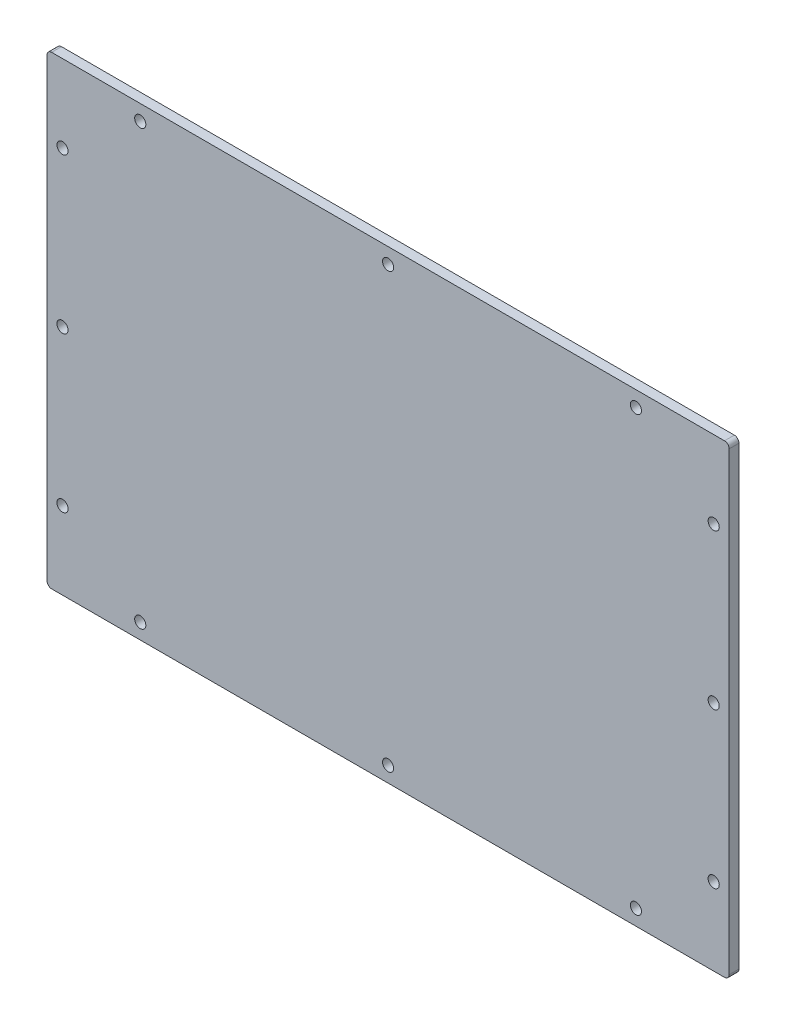
ISO-10303-21;
HEADER;
FILE_DESCRIPTION(('STEP AP214'),'2;1');
FILE_NAME('part.step','',(''),(''),'','','');
FILE_SCHEMA(('AUTOMOTIVE_DESIGN { 1 0 10303 214 1 1 1 1 }'));
ENDSEC;
DATA;
#1=APPLICATION_CONTEXT('core data for automotive mechanical design processes');
#2=APPLICATION_PROTOCOL_DEFINITION('international standard','automotive_design',2000,#1);
#3=PRODUCT_CONTEXT('',#1,'mechanical');
#4=PRODUCT('Part','Part','',(#3));
#5=PRODUCT_RELATED_PRODUCT_CATEGORY('part','',(#4));
#6=PRODUCT_DEFINITION_FORMATION('','',#4);
#7=PRODUCT_DEFINITION_CONTEXT('part definition',#1,'design');
#8=PRODUCT_DEFINITION('design','',#6,#7);
#9=PRODUCT_DEFINITION_SHAPE('','',#8);
#10=(LENGTH_UNIT() NAMED_UNIT(*) SI_UNIT(.MILLI.,.METRE.));
#11=(NAMED_UNIT(*) PLANE_ANGLE_UNIT() SI_UNIT($,.RADIAN.));
#12=(NAMED_UNIT(*) SI_UNIT($,.STERADIAN.) SOLID_ANGLE_UNIT());
#13=UNCERTAINTY_MEASURE_WITH_UNIT(LENGTH_MEASURE(1.E-05),#10,'distance_accuracy_value','');
#14=(GEOMETRIC_REPRESENTATION_CONTEXT(3) GLOBAL_UNCERTAINTY_ASSIGNED_CONTEXT((#13)) GLOBAL_UNIT_ASSIGNED_CONTEXT((#10,
#11,#12)) REPRESENTATION_CONTEXT('',''));
#15=CARTESIAN_POINT('',(0.,0.,0.));
#16=DIRECTION('',(0.,0.,1.));
#17=DIRECTION('',(1.,0.,0.));
#18=AXIS2_PLACEMENT_3D('',#15,#16,#17);
#19=CARTESIAN_POINT('',(0.,-75.,3.175));
#20=DIRECTION('',(0.,1.,0.));
#21=DIRECTION('',(0.,0.,1.));
#22=AXIS2_PLACEMENT_3D('',#19,#20,#21);
#23=PLANE('',#22);
#24=DIRECTION('',(1.,0.,0.));
#25=VECTOR('',#24,1.);
#26=CARTESIAN_POINT('',(0.,-75.,3.175));
#27=LINE('',#26,#25);
#28=CARTESIAN_POINT('',(-108.605,-75.,3.175));
#29=VERTEX_POINT('',#28);
#30=CARTESIAN_POINT('',(108.605,-75.,3.175));
#31=VERTEX_POINT('',#30);
#32=EDGE_CURVE('E126',#29,#31,#27,.T.);
#33=ORIENTED_EDGE('',*,*,#32,.F.);
#34=DIRECTION('',(0.,0.,-1.));
#35=VECTOR('',#34,1.);
#36=CARTESIAN_POINT('',(-108.605,-75.,0.));
#37=LINE('',#36,#35);
#38=CARTESIAN_POINT('',(-108.605,-75.,0.));
#39=VERTEX_POINT('',#38);
#40=EDGE_CURVE('E111',#29,#39,#37,.T.);
#41=ORIENTED_EDGE('',*,*,#40,.T.);
#42=DIRECTION('',(1.,0.,0.));
#43=VECTOR('',#42,1.);
#44=CARTESIAN_POINT('',(0.,-75.,0.));
#45=LINE('',#44,#43);
#46=CARTESIAN_POINT('',(108.605,-75.,0.));
#47=VERTEX_POINT('',#46);
#48=EDGE_CURVE('E123',#39,#47,#45,.T.);
#49=ORIENTED_EDGE('',*,*,#48,.T.);
#50=DIRECTION('',(0.,0.,-1.));
#51=VECTOR('',#50,1.);
#52=CARTESIAN_POINT('',(108.605,-75.,3.175));
#53=LINE('',#52,#51);
#54=EDGE_CURVE('E128',#47,#31,#53,.F.);
#55=ORIENTED_EDGE('',*,*,#54,.T.);
#56=EDGE_LOOP('',(#33,#41,#49,#55));
#57=FACE_BOUND('',#56,.T.);
#58=ADVANCED_FACE('F41',(#57),#23,.F.);
#59=CARTESIAN_POINT('',(110.105,0.,3.175));
#60=DIRECTION('',(-1.,0.,0.));
#61=DIRECTION('',(0.,0.,1.));
#62=AXIS2_PLACEMENT_3D('',#59,#60,#61);
#63=PLANE('',#62);
#64=DIRECTION('',(0.,1.,0.));
#65=VECTOR('',#64,1.);
#66=CARTESIAN_POINT('',(110.105,0.,3.175));
#67=LINE('',#66,#65);
#68=CARTESIAN_POINT('',(110.105,-73.5,3.175));
#69=VERTEX_POINT('',#68);
#70=CARTESIAN_POINT('',(110.105,73.5,3.175));
#71=VERTEX_POINT('',#70);
#72=EDGE_CURVE('E173',#69,#71,#67,.T.);
#73=ORIENTED_EDGE('',*,*,#72,.F.);
#74=DIRECTION('',(0.,0.,-1.));
#75=VECTOR('',#74,1.);
#76=CARTESIAN_POINT('',(110.105,-73.5,3.175));
#77=LINE('',#76,#75);
#78=CARTESIAN_POINT('',(110.105,-73.5,0.));
#79=VERTEX_POINT('',#78);
#80=EDGE_CURVE('E166',#69,#79,#77,.T.);
#81=ORIENTED_EDGE('',*,*,#80,.T.);
#82=DIRECTION('',(0.,1.,0.));
#83=VECTOR('',#82,1.);
#84=CARTESIAN_POINT('',(110.105,0.,0.));
#85=LINE('',#84,#83);
#86=CARTESIAN_POINT('',(110.105,73.5,0.));
#87=VERTEX_POINT('',#86);
#88=EDGE_CURVE('E132',#79,#87,#85,.T.);
#89=ORIENTED_EDGE('',*,*,#88,.T.);
#90=DIRECTION('',(0.,0.,-1.));
#91=VECTOR('',#90,1.);
#92=CARTESIAN_POINT('',(110.105,73.5,3.175));
#93=LINE('',#92,#91);
#94=EDGE_CURVE('E164',#87,#71,#93,.F.);
#95=ORIENTED_EDGE('',*,*,#94,.T.);
#96=EDGE_LOOP('',(#73,#81,#89,#95));
#97=FACE_BOUND('',#96,.T.);
#98=ADVANCED_FACE('F171',(#97),#63,.F.);
#99=CARTESIAN_POINT('',(0.,75.,3.175));
#100=DIRECTION('',(0.,1.,0.));
#101=DIRECTION('',(0.,0.,1.));
#102=AXIS2_PLACEMENT_3D('',#99,#100,#101);
#103=PLANE('',#102);
#104=DIRECTION('',(1.,0.,0.));
#105=VECTOR('',#104,1.);
#106=CARTESIAN_POINT('',(0.,75.,3.175));
#107=LINE('',#106,#105);
#108=CARTESIAN_POINT('',(-108.605,75.,3.175));
#109=VERTEX_POINT('',#108);
#110=CARTESIAN_POINT('',(108.605,75.,3.175));
#111=VERTEX_POINT('',#110);
#112=EDGE_CURVE('E180',#109,#111,#107,.T.);
#113=ORIENTED_EDGE('',*,*,#112,.T.);
#114=DIRECTION('',(0.,0.,-1.));
#115=VECTOR('',#114,1.);
#116=CARTESIAN_POINT('',(108.605,75.,0.));
#117=LINE('',#116,#115);
#118=CARTESIAN_POINT('',(108.605,75.,0.));
#119=VERTEX_POINT('',#118);
#120=EDGE_CURVE('E11',#111,#119,#117,.T.);
#121=ORIENTED_EDGE('',*,*,#120,.T.);
#122=DIRECTION('',(1.,0.,0.));
#123=VECTOR('',#122,1.);
#124=CARTESIAN_POINT('',(0.,75.,0.));
#125=LINE('',#124,#123);
#126=CARTESIAN_POINT('',(-108.605,75.,0.));
#127=VERTEX_POINT('',#126);
#128=EDGE_CURVE('E136',#127,#119,#125,.T.);
#129=ORIENTED_EDGE('',*,*,#128,.F.);
#130=DIRECTION('',(0.,0.,-1.));
#131=VECTOR('',#130,1.);
#132=CARTESIAN_POINT('',(-108.605,75.,3.175));
#133=LINE('',#132,#131);
#134=EDGE_CURVE('E49',#127,#109,#133,.F.);
#135=ORIENTED_EDGE('',*,*,#134,.T.);
#136=EDGE_LOOP('',(#113,#121,#129,#135));
#137=FACE_BOUND('',#136,.T.);
#138=ADVANCED_FACE('F179',(#137),#103,.T.);
#139=CARTESIAN_POINT('',(-110.105,0.,3.175));
#140=DIRECTION('',(-1.,0.,0.));
#141=DIRECTION('',(0.,0.,1.));
#142=AXIS2_PLACEMENT_3D('',#139,#140,#141);
#143=PLANE('',#142);
#144=DIRECTION('',(0.,1.,0.));
#145=VECTOR('',#144,1.);
#146=CARTESIAN_POINT('',(-110.105,0.,0.));
#147=LINE('',#146,#145);
#148=CARTESIAN_POINT('',(-110.105,-73.5,0.));
#149=VERTEX_POINT('',#148);
#150=CARTESIAN_POINT('',(-110.105,73.5,0.));
#151=VERTEX_POINT('',#150);
#152=EDGE_CURVE('E147',#149,#151,#147,.T.);
#153=ORIENTED_EDGE('',*,*,#152,.F.);
#154=DIRECTION('',(0.,0.,-1.));
#155=VECTOR('',#154,1.);
#156=CARTESIAN_POINT('',(-110.105,-73.5,3.175));
#157=LINE('',#156,#155);
#158=CARTESIAN_POINT('',(-110.105,-73.5,3.175));
#159=VERTEX_POINT('',#158);
#160=EDGE_CURVE('E112',#149,#159,#157,.F.);
#161=ORIENTED_EDGE('',*,*,#160,.T.);
#162=DIRECTION('',(0.,1.,0.));
#163=VECTOR('',#162,1.);
#164=CARTESIAN_POINT('',(-110.105,0.,3.175));
#165=LINE('',#164,#163);
#166=CARTESIAN_POINT('',(-110.105,73.5,3.175));
#167=VERTEX_POINT('',#166);
#168=EDGE_CURVE('E142',#159,#167,#165,.T.);
#169=ORIENTED_EDGE('',*,*,#168,.T.);
#170=DIRECTION('',(0.,0.,-1.));
#171=VECTOR('',#170,1.);
#172=CARTESIAN_POINT('',(-110.105,73.5,3.175));
#173=LINE('',#172,#171);
#174=EDGE_CURVE('E117',#167,#151,#173,.T.);
#175=ORIENTED_EDGE('',*,*,#174,.T.);
#176=EDGE_LOOP('',(#153,#161,#169,#175));
#177=FACE_BOUND('',#176,.T.);
#178=ADVANCED_FACE('F260',(#177),#143,.T.);
#179=CARTESIAN_POINT('',(0.,0.,3.175));
#180=DIRECTION('',(0.,0.,1.));
#181=DIRECTION('',(1.,0.,0.));
#182=AXIS2_PLACEMENT_3D('',#179,#180,#181);
#183=PLANE('',#182);
#184=CARTESIAN_POINT('',(-80.,70.,3.175));
#185=DIRECTION('',(0.,0.,1.));
#186=DIRECTION('',(1.,0.,0.));
#187=AXIS2_PLACEMENT_3D('',#184,#185,#186);
#188=CIRCLE('',#187,1.8);
#189=CARTESIAN_POINT('',(-78.2,70.,3.175));
#190=VERTEX_POINT('',#189);
#191=EDGE_CURVE('E251',#190,#190,#188,.T.);
#192=ORIENTED_EDGE('',*,*,#191,.F.);
#193=EDGE_LOOP('',(#192));
#194=FACE_BOUND('',#193,.T.);
#195=CARTESIAN_POINT('',(80.,70.,3.175));
#196=DIRECTION('',(0.,0.,1.));
#197=DIRECTION('',(1.,0.,0.));
#198=AXIS2_PLACEMENT_3D('',#195,#196,#197);
#199=CIRCLE('',#198,1.8);
#200=CARTESIAN_POINT('',(81.8,70.,3.175));
#201=VERTEX_POINT('',#200);
#202=EDGE_CURVE('E245',#201,#201,#199,.T.);
#203=ORIENTED_EDGE('',*,*,#202,.F.);
#204=EDGE_LOOP('',(#203));
#205=FACE_BOUND('',#204,.T.);
#206=CARTESIAN_POINT('',(0.,70.,3.175));
#207=DIRECTION('',(0.,0.,1.));
#208=DIRECTION('',(1.,0.,0.));
#209=AXIS2_PLACEMENT_3D('',#206,#207,#208);
#210=CIRCLE('',#209,1.8);
#211=CARTESIAN_POINT('',(1.8,70.,3.175));
#212=VERTEX_POINT('',#211);
#213=EDGE_CURVE('E239',#212,#212,#210,.T.);
#214=ORIENTED_EDGE('',*,*,#213,.F.);
#215=EDGE_LOOP('',(#214));
#216=FACE_BOUND('',#215,.T.);
#217=CARTESIAN_POINT('',(-105.105,50.,3.175));
#218=DIRECTION('',(0.,0.,1.));
#219=DIRECTION('',(1.,0.,0.));
#220=AXIS2_PLACEMENT_3D('',#217,#218,#219);
#221=CIRCLE('',#220,1.8);
#222=CARTESIAN_POINT('',(-103.305,50.,3.175));
#223=VERTEX_POINT('',#222);
#224=EDGE_CURVE('E233',#223,#223,#221,.T.);
#225=ORIENTED_EDGE('',*,*,#224,.F.);
#226=EDGE_LOOP('',(#225));
#227=FACE_BOUND('',#226,.T.);
#228=CARTESIAN_POINT('',(-105.105,0.,3.175));
#229=DIRECTION('',(0.,0.,1.));
#230=DIRECTION('',(1.,0.,0.));
#231=AXIS2_PLACEMENT_3D('',#228,#229,#230);
#232=CIRCLE('',#231,1.8);
#233=CARTESIAN_POINT('',(-103.305,0.,3.175));
#234=VERTEX_POINT('',#233);
#235=EDGE_CURVE('E227',#234,#234,#232,.T.);
#236=ORIENTED_EDGE('',*,*,#235,.F.);
#237=EDGE_LOOP('',(#236));
#238=FACE_BOUND('',#237,.T.);
#239=CARTESIAN_POINT('',(-105.105,-50.,3.175));
#240=DIRECTION('',(0.,0.,1.));
#241=DIRECTION('',(1.,0.,0.));
#242=AXIS2_PLACEMENT_3D('',#239,#240,#241);
#243=CIRCLE('',#242,1.8);
#244=CARTESIAN_POINT('',(-103.305,-50.,3.175));
#245=VERTEX_POINT('',#244);
#246=EDGE_CURVE('E221',#245,#245,#243,.T.);
#247=ORIENTED_EDGE('',*,*,#246,.F.);
#248=EDGE_LOOP('',(#247));
#249=FACE_BOUND('',#248,.T.);
#250=CARTESIAN_POINT('',(-80.,-70.,3.175));
#251=DIRECTION('',(0.,0.,1.));
#252=DIRECTION('',(1.,0.,0.));
#253=AXIS2_PLACEMENT_3D('',#250,#251,#252);
#254=CIRCLE('',#253,1.8);
#255=CARTESIAN_POINT('',(-78.2,-70.,3.175));
#256=VERTEX_POINT('',#255);
#257=EDGE_CURVE('E215',#256,#256,#254,.T.);
#258=ORIENTED_EDGE('',*,*,#257,.F.);
#259=EDGE_LOOP('',(#258));
#260=FACE_BOUND('',#259,.T.);
#261=CARTESIAN_POINT('',(0.,-70.,3.175));
#262=DIRECTION('',(0.,0.,1.));
#263=DIRECTION('',(1.,0.,0.));
#264=AXIS2_PLACEMENT_3D('',#261,#262,#263);
#265=CIRCLE('',#264,1.8);
#266=CARTESIAN_POINT('',(1.80000000000003,-70.,3.175));
#267=VERTEX_POINT('',#266);
#268=EDGE_CURVE('E209',#267,#267,#265,.T.);
#269=ORIENTED_EDGE('',*,*,#268,.F.);
#270=EDGE_LOOP('',(#269));
#271=FACE_BOUND('',#270,.T.);
#272=CARTESIAN_POINT('',(80.,-69.9999999999999,3.175));
#273=DIRECTION('',(0.,0.,1.));
#274=DIRECTION('',(1.,0.,0.));
#275=AXIS2_PLACEMENT_3D('',#272,#273,#274);
#276=CIRCLE('',#275,1.8);
#277=CARTESIAN_POINT('',(81.8,-69.9999999999999,3.175));
#278=VERTEX_POINT('',#277);
#279=EDGE_CURVE('E203',#278,#278,#276,.T.);
#280=ORIENTED_EDGE('',*,*,#279,.F.);
#281=EDGE_LOOP('',(#280));
#282=FACE_BOUND('',#281,.T.);
#283=CARTESIAN_POINT('',(105.105,-50.,3.175));
#284=DIRECTION('',(0.,0.,1.));
#285=DIRECTION('',(1.,0.,0.));
#286=AXIS2_PLACEMENT_3D('',#283,#284,#285);
#287=CIRCLE('',#286,1.8);
#288=CARTESIAN_POINT('',(106.905,-50.,3.175));
#289=VERTEX_POINT('',#288);
#290=EDGE_CURVE('E197',#289,#289,#287,.T.);
#291=ORIENTED_EDGE('',*,*,#290,.F.);
#292=EDGE_LOOP('',(#291));
#293=FACE_BOUND('',#292,.T.);
#294=CARTESIAN_POINT('',(105.105,0.,3.175));
#295=DIRECTION('',(0.,0.,1.));
#296=DIRECTION('',(1.,0.,0.));
#297=AXIS2_PLACEMENT_3D('',#294,#295,#296);
#298=CIRCLE('',#297,1.8);
#299=CARTESIAN_POINT('',(106.905,0.,3.175));
#300=VERTEX_POINT('',#299);
#301=EDGE_CURVE('E191',#300,#300,#298,.T.);
#302=ORIENTED_EDGE('',*,*,#301,.F.);
#303=EDGE_LOOP('',(#302));
#304=FACE_BOUND('',#303,.T.);
#305=CARTESIAN_POINT('',(105.105,50.,3.175));
#306=DIRECTION('',(0.,0.,1.));
#307=DIRECTION('',(1.,0.,0.));
#308=AXIS2_PLACEMENT_3D('',#305,#306,#307);
#309=CIRCLE('',#308,1.8);
#310=CARTESIAN_POINT('',(106.905,50.,3.175));
#311=VERTEX_POINT('',#310);
#312=EDGE_CURVE('E139',#311,#311,#309,.T.);
#313=ORIENTED_EDGE('',*,*,#312,.F.);
#314=EDGE_LOOP('',(#313));
#315=FACE_BOUND('',#314,.T.);
#316=ORIENTED_EDGE('',*,*,#168,.F.);
#317=CARTESIAN_POINT('',(-108.605,-73.5,3.175));
#318=DIRECTION('',(0.,0.,1.));
#319=DIRECTION('',(1.,0.,0.));
#320=AXIS2_PLACEMENT_3D('',#317,#318,#319);
#321=CIRCLE('',#320,1.5);
#322=EDGE_CURVE('E162',#159,#29,#321,.T.);
#323=ORIENTED_EDGE('',*,*,#322,.T.);
#324=ORIENTED_EDGE('',*,*,#32,.T.);
#325=CARTESIAN_POINT('',(108.605,-73.5,3.175));
#326=DIRECTION('',(0.,0.,1.));
#327=DIRECTION('',(1.,0.,0.));
#328=AXIS2_PLACEMENT_3D('',#325,#326,#327);
#329=CIRCLE('',#328,1.5);
#330=EDGE_CURVE('E160',#31,#69,#329,.T.);
#331=ORIENTED_EDGE('',*,*,#330,.T.);
#332=ORIENTED_EDGE('',*,*,#72,.T.);
#333=CARTESIAN_POINT('',(108.605,73.5,3.175));
#334=DIRECTION('',(0.,0.,1.));
#335=DIRECTION('',(1.,0.,0.));
#336=AXIS2_PLACEMENT_3D('',#333,#334,#335);
#337=CIRCLE('',#336,1.5);
#338=EDGE_CURVE('E56',#71,#111,#337,.T.);
#339=ORIENTED_EDGE('',*,*,#338,.T.);
#340=ORIENTED_EDGE('',*,*,#112,.F.);
#341=CARTESIAN_POINT('',(-108.605,73.5,3.175));
#342=DIRECTION('',(0.,0.,1.));
#343=DIRECTION('',(1.,0.,0.));
#344=AXIS2_PLACEMENT_3D('',#341,#342,#343);
#345=CIRCLE('',#344,1.5);
#346=EDGE_CURVE('E157',#109,#167,#345,.T.);
#347=ORIENTED_EDGE('',*,*,#346,.T.);
#348=EDGE_LOOP('',(#316,#323,#324,#331,#332,#339,#340,#347));
#349=FACE_BOUND('',#348,.T.);
#350=ADVANCED_FACE('F257',(#194,#205,#216,#227,#238,#249,#260,#271,#282,#293,#304,#315,#349),
#183,.T.);
#351=CARTESIAN_POINT('',(0.,0.,0.));
#352=DIRECTION('',(0.,0.,1.));
#353=DIRECTION('',(1.,0.,0.));
#354=AXIS2_PLACEMENT_3D('',#351,#352,#353);
#355=PLANE('',#354);
#356=CARTESIAN_POINT('',(-80.,70.,0.));
#357=DIRECTION('',(0.,0.,1.));
#358=DIRECTION('',(1.,0.,0.));
#359=AXIS2_PLACEMENT_3D('',#356,#357,#358);
#360=CIRCLE('',#359,1.8);
#361=CARTESIAN_POINT('',(-78.2,70.,0.));
#362=VERTEX_POINT('',#361);
#363=EDGE_CURVE('E248',#362,#362,#360,.T.);
#364=ORIENTED_EDGE('',*,*,#363,.T.);
#365=EDGE_LOOP('',(#364));
#366=FACE_BOUND('',#365,.T.);
#367=CARTESIAN_POINT('',(80.,70.,0.));
#368=DIRECTION('',(0.,0.,1.));
#369=DIRECTION('',(1.,0.,0.));
#370=AXIS2_PLACEMENT_3D('',#367,#368,#369);
#371=CIRCLE('',#370,1.8);
#372=CARTESIAN_POINT('',(81.8,70.,0.));
#373=VERTEX_POINT('',#372);
#374=EDGE_CURVE('E242',#373,#373,#371,.T.);
#375=ORIENTED_EDGE('',*,*,#374,.T.);
#376=EDGE_LOOP('',(#375));
#377=FACE_BOUND('',#376,.T.);
#378=CARTESIAN_POINT('',(0.,70.,0.));
#379=DIRECTION('',(0.,0.,1.));
#380=DIRECTION('',(1.,0.,0.));
#381=AXIS2_PLACEMENT_3D('',#378,#379,#380);
#382=CIRCLE('',#381,1.8);
#383=CARTESIAN_POINT('',(1.8,70.,0.));
#384=VERTEX_POINT('',#383);
#385=EDGE_CURVE('E236',#384,#384,#382,.T.);
#386=ORIENTED_EDGE('',*,*,#385,.T.);
#387=EDGE_LOOP('',(#386));
#388=FACE_BOUND('',#387,.T.);
#389=CARTESIAN_POINT('',(-105.105,50.,0.));
#390=DIRECTION('',(0.,0.,1.));
#391=DIRECTION('',(1.,0.,0.));
#392=AXIS2_PLACEMENT_3D('',#389,#390,#391);
#393=CIRCLE('',#392,1.8);
#394=CARTESIAN_POINT('',(-103.305,50.,0.));
#395=VERTEX_POINT('',#394);
#396=EDGE_CURVE('E230',#395,#395,#393,.T.);
#397=ORIENTED_EDGE('',*,*,#396,.T.);
#398=EDGE_LOOP('',(#397));
#399=FACE_BOUND('',#398,.T.);
#400=CARTESIAN_POINT('',(-105.105,0.,0.));
#401=DIRECTION('',(0.,0.,1.));
#402=DIRECTION('',(1.,0.,0.));
#403=AXIS2_PLACEMENT_3D('',#400,#401,#402);
#404=CIRCLE('',#403,1.8);
#405=CARTESIAN_POINT('',(-103.305,0.,0.));
#406=VERTEX_POINT('',#405);
#407=EDGE_CURVE('E224',#406,#406,#404,.T.);
#408=ORIENTED_EDGE('',*,*,#407,.T.);
#409=EDGE_LOOP('',(#408));
#410=FACE_BOUND('',#409,.T.);
#411=CARTESIAN_POINT('',(-105.105,-50.,0.));
#412=DIRECTION('',(0.,0.,1.));
#413=DIRECTION('',(1.,0.,0.));
#414=AXIS2_PLACEMENT_3D('',#411,#412,#413);
#415=CIRCLE('',#414,1.8);
#416=CARTESIAN_POINT('',(-103.305,-50.,0.));
#417=VERTEX_POINT('',#416);
#418=EDGE_CURVE('E218',#417,#417,#415,.T.);
#419=ORIENTED_EDGE('',*,*,#418,.T.);
#420=EDGE_LOOP('',(#419));
#421=FACE_BOUND('',#420,.T.);
#422=CARTESIAN_POINT('',(-80.,-70.,0.));
#423=DIRECTION('',(0.,0.,1.));
#424=DIRECTION('',(1.,0.,0.));
#425=AXIS2_PLACEMENT_3D('',#422,#423,#424);
#426=CIRCLE('',#425,1.8);
#427=CARTESIAN_POINT('',(-78.2,-70.,0.));
#428=VERTEX_POINT('',#427);
#429=EDGE_CURVE('E212',#428,#428,#426,.T.);
#430=ORIENTED_EDGE('',*,*,#429,.T.);
#431=EDGE_LOOP('',(#430));
#432=FACE_BOUND('',#431,.T.);
#433=CARTESIAN_POINT('',(0.,-70.,0.));
#434=DIRECTION('',(0.,0.,1.));
#435=DIRECTION('',(1.,0.,0.));
#436=AXIS2_PLACEMENT_3D('',#433,#434,#435);
#437=CIRCLE('',#436,1.8);
#438=CARTESIAN_POINT('',(1.80000000000003,-70.,0.));
#439=VERTEX_POINT('',#438);
#440=EDGE_CURVE('E206',#439,#439,#437,.T.);
#441=ORIENTED_EDGE('',*,*,#440,.T.);
#442=EDGE_LOOP('',(#441));
#443=FACE_BOUND('',#442,.T.);
#444=CARTESIAN_POINT('',(80.,-69.9999999999999,0.));
#445=DIRECTION('',(0.,0.,1.));
#446=DIRECTION('',(1.,0.,0.));
#447=AXIS2_PLACEMENT_3D('',#444,#445,#446);
#448=CIRCLE('',#447,1.8);
#449=CARTESIAN_POINT('',(81.8,-69.9999999999999,0.));
#450=VERTEX_POINT('',#449);
#451=EDGE_CURVE('E200',#450,#450,#448,.T.);
#452=ORIENTED_EDGE('',*,*,#451,.T.);
#453=EDGE_LOOP('',(#452));
#454=FACE_BOUND('',#453,.T.);
#455=CARTESIAN_POINT('',(105.105,-50.,0.));
#456=DIRECTION('',(0.,0.,1.));
#457=DIRECTION('',(1.,0.,0.));
#458=AXIS2_PLACEMENT_3D('',#455,#456,#457);
#459=CIRCLE('',#458,1.8);
#460=CARTESIAN_POINT('',(106.905,-50.,0.));
#461=VERTEX_POINT('',#460);
#462=EDGE_CURVE('E194',#461,#461,#459,.T.);
#463=ORIENTED_EDGE('',*,*,#462,.T.);
#464=EDGE_LOOP('',(#463));
#465=FACE_BOUND('',#464,.T.);
#466=CARTESIAN_POINT('',(105.105,0.,0.));
#467=DIRECTION('',(0.,0.,1.));
#468=DIRECTION('',(1.,0.,0.));
#469=AXIS2_PLACEMENT_3D('',#466,#467,#468);
#470=CIRCLE('',#469,1.8);
#471=CARTESIAN_POINT('',(106.905,0.,0.));
#472=VERTEX_POINT('',#471);
#473=EDGE_CURVE('E188',#472,#472,#470,.T.);
#474=ORIENTED_EDGE('',*,*,#473,.T.);
#475=EDGE_LOOP('',(#474));
#476=FACE_BOUND('',#475,.T.);
#477=CARTESIAN_POINT('',(105.105,50.,0.));
#478=DIRECTION('',(0.,0.,1.));
#479=DIRECTION('',(1.,0.,0.));
#480=AXIS2_PLACEMENT_3D('',#477,#478,#479);
#481=CIRCLE('',#480,1.8);
#482=CARTESIAN_POINT('',(106.905,50.,0.));
#483=VERTEX_POINT('',#482);
#484=EDGE_CURVE('E133',#483,#483,#481,.T.);
#485=ORIENTED_EDGE('',*,*,#484,.T.);
#486=EDGE_LOOP('',(#485));
#487=FACE_BOUND('',#486,.T.);
#488=ORIENTED_EDGE('',*,*,#48,.F.);
#489=CARTESIAN_POINT('',(-108.605,-73.5,0.));
#490=DIRECTION('',(0.,0.,1.));
#491=DIRECTION('',(1.,0.,0.));
#492=AXIS2_PLACEMENT_3D('',#489,#490,#491);
#493=CIRCLE('',#492,1.5);
#494=EDGE_CURVE('E107',#39,#149,#493,.F.);
#495=ORIENTED_EDGE('',*,*,#494,.T.);
#496=ORIENTED_EDGE('',*,*,#152,.T.);
#497=CARTESIAN_POINT('',(-108.605,73.5,0.));
#498=DIRECTION('',(0.,0.,1.));
#499=DIRECTION('',(1.,0.,0.));
#500=AXIS2_PLACEMENT_3D('',#497,#498,#499);
#501=CIRCLE('',#500,1.5);
#502=EDGE_CURVE('E127',#151,#127,#501,.F.);
#503=ORIENTED_EDGE('',*,*,#502,.T.);
#504=ORIENTED_EDGE('',*,*,#128,.T.);
#505=CARTESIAN_POINT('',(108.605,73.5,0.));
#506=DIRECTION('',(0.,0.,1.));
#507=DIRECTION('',(1.,0.,0.));
#508=AXIS2_PLACEMENT_3D('',#505,#506,#507);
#509=CIRCLE('',#508,1.5);
#510=EDGE_CURVE('E151',#119,#87,#509,.F.);
#511=ORIENTED_EDGE('',*,*,#510,.T.);
#512=ORIENTED_EDGE('',*,*,#88,.F.);
#513=CARTESIAN_POINT('',(108.605,-73.5,0.));
#514=DIRECTION('',(0.,0.,1.));
#515=DIRECTION('',(1.,0.,0.));
#516=AXIS2_PLACEMENT_3D('',#513,#514,#515);
#517=CIRCLE('',#516,1.5);
#518=EDGE_CURVE('E118',#79,#47,#517,.F.);
#519=ORIENTED_EDGE('',*,*,#518,.T.);
#520=EDGE_LOOP('',(#488,#495,#496,#503,#504,#511,#512,#519));
#521=FACE_BOUND('',#520,.T.);
#522=ADVANCED_FACE('F130',(#366,#377,#388,#399,#410,#421,#432,#443,#454,#465,#476,#487,#521),
#355,.F.);
#523=CARTESIAN_POINT('',(105.105,50.,3.175));
#524=DIRECTION('',(0.,0.,1.));
#525=DIRECTION('',(1.,0.,0.));
#526=AXIS2_PLACEMENT_3D('',#523,#524,#525);
#527=CYLINDRICAL_SURFACE('',#526,1.8);
#528=ORIENTED_EDGE('',*,*,#484,.F.);
#529=EDGE_LOOP('',(#528));
#530=FACE_BOUND('',#529,.T.);
#531=ORIENTED_EDGE('',*,*,#312,.T.);
#532=EDGE_LOOP('',(#531));
#533=FACE_BOUND('',#532,.T.);
#534=ADVANCED_FACE('F333',(#530,#533),#527,.F.);
#535=CARTESIAN_POINT('',(105.105,0.,3.175));
#536=DIRECTION('',(0.,0.,1.));
#537=DIRECTION('',(1.,0.,0.));
#538=AXIS2_PLACEMENT_3D('',#535,#536,#537);
#539=CYLINDRICAL_SURFACE('',#538,1.8);
#540=ORIENTED_EDGE('',*,*,#473,.F.);
#541=EDGE_LOOP('',(#540));
#542=FACE_BOUND('',#541,.T.);
#543=ORIENTED_EDGE('',*,*,#301,.T.);
#544=EDGE_LOOP('',(#543));
#545=FACE_BOUND('',#544,.T.);
#546=ADVANCED_FACE('F435',(#542,#545),#539,.F.);
#547=CARTESIAN_POINT('',(105.105,-50.,3.175));
#548=DIRECTION('',(0.,0.,1.));
#549=DIRECTION('',(1.,0.,0.));
#550=AXIS2_PLACEMENT_3D('',#547,#548,#549);
#551=CYLINDRICAL_SURFACE('',#550,1.8);
#552=ORIENTED_EDGE('',*,*,#462,.F.);
#553=EDGE_LOOP('',(#552));
#554=FACE_BOUND('',#553,.T.);
#555=ORIENTED_EDGE('',*,*,#290,.T.);
#556=EDGE_LOOP('',(#555));
#557=FACE_BOUND('',#556,.T.);
#558=ADVANCED_FACE('F426',(#554,#557),#551,.F.);
#559=CARTESIAN_POINT('',(80.,-69.9999999999999,3.175));
#560=DIRECTION('',(0.,0.,1.));
#561=DIRECTION('',(1.,0.,0.));
#562=AXIS2_PLACEMENT_3D('',#559,#560,#561);
#563=CYLINDRICAL_SURFACE('',#562,1.8);
#564=ORIENTED_EDGE('',*,*,#451,.F.);
#565=EDGE_LOOP('',(#564));
#566=FACE_BOUND('',#565,.T.);
#567=ORIENTED_EDGE('',*,*,#279,.T.);
#568=EDGE_LOOP('',(#567));
#569=FACE_BOUND('',#568,.T.);
#570=ADVANCED_FACE('F417',(#566,#569),#563,.F.);
#571=CARTESIAN_POINT('',(0.,-70.,3.175));
#572=DIRECTION('',(0.,0.,1.));
#573=DIRECTION('',(1.,0.,0.));
#574=AXIS2_PLACEMENT_3D('',#571,#572,#573);
#575=CYLINDRICAL_SURFACE('',#574,1.8);
#576=ORIENTED_EDGE('',*,*,#440,.F.);
#577=EDGE_LOOP('',(#576));
#578=FACE_BOUND('',#577,.T.);
#579=ORIENTED_EDGE('',*,*,#268,.T.);
#580=EDGE_LOOP('',(#579));
#581=FACE_BOUND('',#580,.T.);
#582=ADVANCED_FACE('F408',(#578,#581),#575,.F.);
#583=CARTESIAN_POINT('',(-80.,-70.,3.175));
#584=DIRECTION('',(0.,0.,1.));
#585=DIRECTION('',(1.,0.,0.));
#586=AXIS2_PLACEMENT_3D('',#583,#584,#585);
#587=CYLINDRICAL_SURFACE('',#586,1.8);
#588=ORIENTED_EDGE('',*,*,#429,.F.);
#589=EDGE_LOOP('',(#588));
#590=FACE_BOUND('',#589,.T.);
#591=ORIENTED_EDGE('',*,*,#257,.T.);
#592=EDGE_LOOP('',(#591));
#593=FACE_BOUND('',#592,.T.);
#594=ADVANCED_FACE('F399',(#590,#593),#587,.F.);
#595=CARTESIAN_POINT('',(-105.105,-50.,3.175));
#596=DIRECTION('',(0.,0.,1.));
#597=DIRECTION('',(1.,0.,0.));
#598=AXIS2_PLACEMENT_3D('',#595,#596,#597);
#599=CYLINDRICAL_SURFACE('',#598,1.8);
#600=ORIENTED_EDGE('',*,*,#418,.F.);
#601=EDGE_LOOP('',(#600));
#602=FACE_BOUND('',#601,.T.);
#603=ORIENTED_EDGE('',*,*,#246,.T.);
#604=EDGE_LOOP('',(#603));
#605=FACE_BOUND('',#604,.T.);
#606=ADVANCED_FACE('F390',(#602,#605),#599,.F.);
#607=CARTESIAN_POINT('',(-105.105,0.,3.175));
#608=DIRECTION('',(0.,0.,1.));
#609=DIRECTION('',(1.,0.,0.));
#610=AXIS2_PLACEMENT_3D('',#607,#608,#609);
#611=CYLINDRICAL_SURFACE('',#610,1.8);
#612=ORIENTED_EDGE('',*,*,#407,.F.);
#613=EDGE_LOOP('',(#612));
#614=FACE_BOUND('',#613,.T.);
#615=ORIENTED_EDGE('',*,*,#235,.T.);
#616=EDGE_LOOP('',(#615));
#617=FACE_BOUND('',#616,.T.);
#618=ADVANCED_FACE('F381',(#614,#617),#611,.F.);
#619=CARTESIAN_POINT('',(-105.105,50.,3.175));
#620=DIRECTION('',(0.,0.,1.));
#621=DIRECTION('',(1.,0.,0.));
#622=AXIS2_PLACEMENT_3D('',#619,#620,#621);
#623=CYLINDRICAL_SURFACE('',#622,1.8);
#624=ORIENTED_EDGE('',*,*,#396,.F.);
#625=EDGE_LOOP('',(#624));
#626=FACE_BOUND('',#625,.T.);
#627=ORIENTED_EDGE('',*,*,#224,.T.);
#628=EDGE_LOOP('',(#627));
#629=FACE_BOUND('',#628,.T.);
#630=ADVANCED_FACE('F372',(#626,#629),#623,.F.);
#631=CARTESIAN_POINT('',(0.,70.,3.175));
#632=DIRECTION('',(0.,0.,1.));
#633=DIRECTION('',(1.,0.,0.));
#634=AXIS2_PLACEMENT_3D('',#631,#632,#633);
#635=CYLINDRICAL_SURFACE('',#634,1.8);
#636=ORIENTED_EDGE('',*,*,#385,.F.);
#637=EDGE_LOOP('',(#636));
#638=FACE_BOUND('',#637,.T.);
#639=ORIENTED_EDGE('',*,*,#213,.T.);
#640=EDGE_LOOP('',(#639));
#641=FACE_BOUND('',#640,.T.);
#642=ADVANCED_FACE('F363',(#638,#641),#635,.F.);
#643=CARTESIAN_POINT('',(80.,70.,3.175));
#644=DIRECTION('',(0.,0.,1.));
#645=DIRECTION('',(1.,0.,0.));
#646=AXIS2_PLACEMENT_3D('',#643,#644,#645);
#647=CYLINDRICAL_SURFACE('',#646,1.8);
#648=ORIENTED_EDGE('',*,*,#374,.F.);
#649=EDGE_LOOP('',(#648));
#650=FACE_BOUND('',#649,.T.);
#651=ORIENTED_EDGE('',*,*,#202,.T.);
#652=EDGE_LOOP('',(#651));
#653=FACE_BOUND('',#652,.T.);
#654=ADVANCED_FACE('F354',(#650,#653),#647,.F.);
#655=CARTESIAN_POINT('',(-80.,70.,3.175));
#656=DIRECTION('',(0.,0.,1.));
#657=DIRECTION('',(1.,0.,0.));
#658=AXIS2_PLACEMENT_3D('',#655,#656,#657);
#659=CYLINDRICAL_SURFACE('',#658,1.8);
#660=ORIENTED_EDGE('',*,*,#363,.F.);
#661=EDGE_LOOP('',(#660));
#662=FACE_BOUND('',#661,.T.);
#663=ORIENTED_EDGE('',*,*,#191,.T.);
#664=EDGE_LOOP('',(#663));
#665=FACE_BOUND('',#664,.T.);
#666=ADVANCED_FACE('F255',(#662,#665),#659,.F.);
#667=CARTESIAN_POINT('',(-108.605,-73.5,3.175));
#668=DIRECTION('',(0.,0.,1.));
#669=DIRECTION('',(1.,0.,0.));
#670=AXIS2_PLACEMENT_3D('',#667,#668,#669);
#671=CYLINDRICAL_SURFACE('',#670,1.5);
#672=ORIENTED_EDGE('',*,*,#322,.F.);
#673=ORIENTED_EDGE('',*,*,#160,.F.);
#674=ORIENTED_EDGE('',*,*,#494,.F.);
#675=ORIENTED_EDGE('',*,*,#40,.F.);
#676=EDGE_LOOP('',(#672,#673,#674,#675));
#677=FACE_BOUND('',#676,.T.);
#678=ADVANCED_FACE('F110',(#677),#671,.T.);
#679=CARTESIAN_POINT('',(108.605,-73.5,3.175));
#680=DIRECTION('',(0.,0.,-1.));
#681=DIRECTION('',(-1.,0.,0.));
#682=AXIS2_PLACEMENT_3D('',#679,#680,#681);
#683=CYLINDRICAL_SURFACE('',#682,1.5);
#684=ORIENTED_EDGE('',*,*,#330,.F.);
#685=ORIENTED_EDGE('',*,*,#54,.F.);
#686=ORIENTED_EDGE('',*,*,#518,.F.);
#687=ORIENTED_EDGE('',*,*,#80,.F.);
#688=EDGE_LOOP('',(#684,#685,#686,#687));
#689=FACE_BOUND('',#688,.T.);
#690=ADVANCED_FACE('F291',(#689),#683,.T.);
#691=CARTESIAN_POINT('',(108.605,73.5,3.175));
#692=DIRECTION('',(0.,0.,1.));
#693=DIRECTION('',(1.,0.,0.));
#694=AXIS2_PLACEMENT_3D('',#691,#692,#693);
#695=CYLINDRICAL_SURFACE('',#694,1.5);
#696=ORIENTED_EDGE('',*,*,#338,.F.);
#697=ORIENTED_EDGE('',*,*,#94,.F.);
#698=ORIENTED_EDGE('',*,*,#510,.F.);
#699=ORIENTED_EDGE('',*,*,#120,.F.);
#700=EDGE_LOOP('',(#696,#697,#698,#699));
#701=FACE_BOUND('',#700,.T.);
#702=ADVANCED_FACE('F178',(#701),#695,.T.);
#703=CARTESIAN_POINT('',(-108.605,73.5,3.175));
#704=DIRECTION('',(0.,0.,-1.));
#705=DIRECTION('',(-1.,0.,0.));
#706=AXIS2_PLACEMENT_3D('',#703,#704,#705);
#707=CYLINDRICAL_SURFACE('',#706,1.5);
#708=ORIENTED_EDGE('',*,*,#346,.F.);
#709=ORIENTED_EDGE('',*,*,#134,.F.);
#710=ORIENTED_EDGE('',*,*,#502,.F.);
#711=ORIENTED_EDGE('',*,*,#174,.F.);
#712=EDGE_LOOP('',(#708,#709,#710,#711));
#713=FACE_BOUND('',#712,.T.);
#714=ADVANCED_FACE('F43',(#713),#707,.T.);
#715=CLOSED_SHELL('',(#58,#98,#138,#178,#350,#522,#534,#546,#558,#570,#582,#594,#606,#618,#630,
#642,#654,#666,#678,#690,#702,#714));
#716=MANIFOLD_SOLID_BREP('B2',#715);
#717=ADVANCED_BREP_SHAPE_REPRESENTATION('',(#18,#716),#14);
#718=SHAPE_DEFINITION_REPRESENTATION(#9,#717);
ENDSEC;
END-ISO-10303-21;
